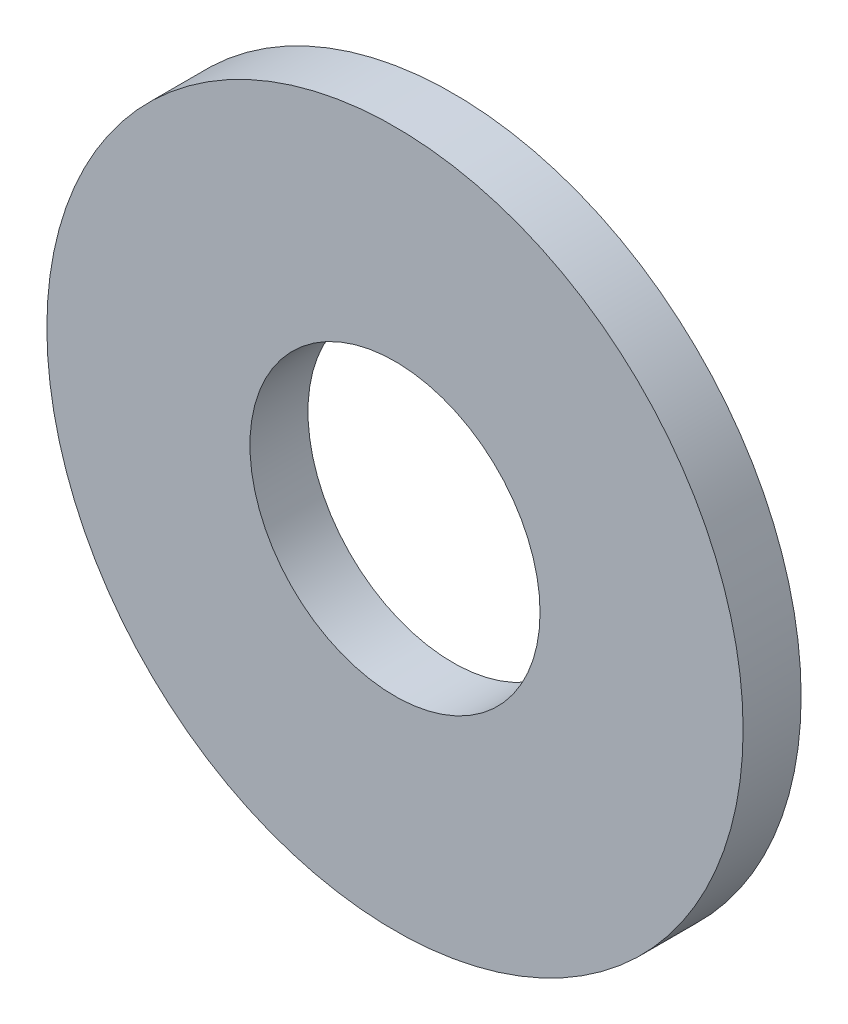
ISO-10303-21;
HEADER;
FILE_DESCRIPTION(('STEP AP214'),'2;1');
FILE_NAME('part.step','',(''),(''),'','','');
FILE_SCHEMA(('AUTOMOTIVE_DESIGN { 1 0 10303 214 1 1 1 1 }'));
ENDSEC;
DATA;
#1=APPLICATION_CONTEXT('core data for automotive mechanical design processes');
#2=APPLICATION_PROTOCOL_DEFINITION('international standard','automotive_design',2000,#1);
#3=PRODUCT_CONTEXT('',#1,'mechanical');
#4=PRODUCT('Part','Part','',(#3));
#5=PRODUCT_RELATED_PRODUCT_CATEGORY('part','',(#4));
#6=PRODUCT_DEFINITION_FORMATION('','',#4);
#7=PRODUCT_DEFINITION_CONTEXT('part definition',#1,'design');
#8=PRODUCT_DEFINITION('design','',#6,#7);
#9=PRODUCT_DEFINITION_SHAPE('','',#8);
#10=(LENGTH_UNIT() NAMED_UNIT(*) SI_UNIT(.MILLI.,.METRE.));
#11=(NAMED_UNIT(*) PLANE_ANGLE_UNIT() SI_UNIT($,.RADIAN.));
#12=(NAMED_UNIT(*) SI_UNIT($,.STERADIAN.) SOLID_ANGLE_UNIT());
#13=UNCERTAINTY_MEASURE_WITH_UNIT(LENGTH_MEASURE(1.E-05),#10,'distance_accuracy_value','');
#14=(GEOMETRIC_REPRESENTATION_CONTEXT(3) GLOBAL_UNCERTAINTY_ASSIGNED_CONTEXT((#13)) GLOBAL_UNIT_ASSIGNED_CONTEXT((#10,
#11,#12)) REPRESENTATION_CONTEXT('',''));
#15=CARTESIAN_POINT('',(0.,0.,0.));
#16=DIRECTION('',(0.,0.,1.));
#17=DIRECTION('',(1.,0.,0.));
#18=AXIS2_PLACEMENT_3D('',#15,#16,#17);
#19=CARTESIAN_POINT('',(0.,0.,1.));
#20=DIRECTION('',(0.,0.,1.));
#21=DIRECTION('',(1.,0.,0.));
#22=AXIS2_PLACEMENT_3D('',#19,#20,#21);
#23=PLANE('',#22);
#24=CARTESIAN_POINT('',(0.,0.,1.));
#25=DIRECTION('',(0.,0.,1.));
#26=DIRECTION('',(1.,0.,0.));
#27=AXIS2_PLACEMENT_3D('',#24,#25,#26);
#28=CIRCLE('',#27,6.);
#29=CARTESIAN_POINT('',(6.,0.,1.));
#30=VERTEX_POINT('',#29);
#31=EDGE_CURVE('E10',#30,#30,#28,.T.);
#32=ORIENTED_EDGE('',*,*,#31,.T.);
#33=EDGE_LOOP('',(#32));
#34=FACE_BOUND('',#33,.T.);
#35=CARTESIAN_POINT('',(0.,0.,1.));
#36=DIRECTION('',(0.,0.,1.));
#37=DIRECTION('',(1.,0.,0.));
#38=AXIS2_PLACEMENT_3D('',#35,#36,#37);
#39=CIRCLE('',#38,2.5);
#40=CARTESIAN_POINT('',(2.5,0.,1.));
#41=VERTEX_POINT('',#40);
#42=EDGE_CURVE('E40',#41,#41,#39,.T.);
#43=ORIENTED_EDGE('',*,*,#42,.F.);
#44=EDGE_LOOP('',(#43));
#45=FACE_BOUND('',#44,.T.);
#46=ADVANCED_FACE('F29',(#34,#45),#23,.T.);
#47=CARTESIAN_POINT('',(0.,0.,0.));
#48=DIRECTION('',(0.,0.,1.));
#49=DIRECTION('',(1.,0.,0.));
#50=AXIS2_PLACEMENT_3D('',#47,#48,#49);
#51=PLANE('',#50);
#52=CARTESIAN_POINT('',(0.,0.,0.));
#53=DIRECTION('',(0.,0.,1.));
#54=DIRECTION('',(1.,0.,0.));
#55=AXIS2_PLACEMENT_3D('',#52,#53,#54);
#56=CIRCLE('',#55,6.);
#57=CARTESIAN_POINT('',(6.,0.,0.));
#58=VERTEX_POINT('',#57);
#59=EDGE_CURVE('E36',#58,#58,#56,.T.);
#60=ORIENTED_EDGE('',*,*,#59,.F.);
#61=EDGE_LOOP('',(#60));
#62=FACE_BOUND('',#61,.T.);
#63=CARTESIAN_POINT('',(0.,0.,0.));
#64=DIRECTION('',(0.,0.,1.));
#65=DIRECTION('',(1.,0.,0.));
#66=AXIS2_PLACEMENT_3D('',#63,#64,#65);
#67=CIRCLE('',#66,2.5);
#68=CARTESIAN_POINT('',(2.5,0.,0.));
#69=VERTEX_POINT('',#68);
#70=EDGE_CURVE('E44',#69,#69,#67,.T.);
#71=ORIENTED_EDGE('',*,*,#70,.T.);
#72=EDGE_LOOP('',(#71));
#73=FACE_BOUND('',#72,.T.);
#74=ADVANCED_FACE('F50',(#62,#73),#51,.F.);
#75=CARTESIAN_POINT('',(0.,0.,1.));
#76=DIRECTION('',(0.,0.,-1.));
#77=DIRECTION('',(-1.,0.,0.));
#78=AXIS2_PLACEMENT_3D('',#75,#76,#77);
#79=CYLINDRICAL_SURFACE('',#78,6.);
#80=ORIENTED_EDGE('',*,*,#31,.F.);
#81=EDGE_LOOP('',(#80));
#82=FACE_BOUND('',#81,.T.);
#83=ORIENTED_EDGE('',*,*,#59,.T.);
#84=EDGE_LOOP('',(#83));
#85=FACE_BOUND('',#84,.T.);
#86=ADVANCED_FACE('F31',(#82,#85),#79,.T.);
#87=CARTESIAN_POINT('',(0.,0.,1.));
#88=DIRECTION('',(0.,0.,-1.));
#89=DIRECTION('',(-1.,0.,0.));
#90=AXIS2_PLACEMENT_3D('',#87,#88,#89);
#91=CYLINDRICAL_SURFACE('',#90,2.5);
#92=ORIENTED_EDGE('',*,*,#42,.T.);
#93=EDGE_LOOP('',(#92));
#94=FACE_BOUND('',#93,.T.);
#95=ORIENTED_EDGE('',*,*,#70,.F.);
#96=EDGE_LOOP('',(#95));
#97=FACE_BOUND('',#96,.T.);
#98=ADVANCED_FACE('F52',(#94,#97),#91,.F.);
#99=CLOSED_SHELL('',(#46,#74,#86,#98));
#100=MANIFOLD_SOLID_BREP('B2',#99);
#101=ADVANCED_BREP_SHAPE_REPRESENTATION('',(#18,#100),#14);
#102=SHAPE_DEFINITION_REPRESENTATION(#9,#101);
ENDSEC;
END-ISO-10303-21;
